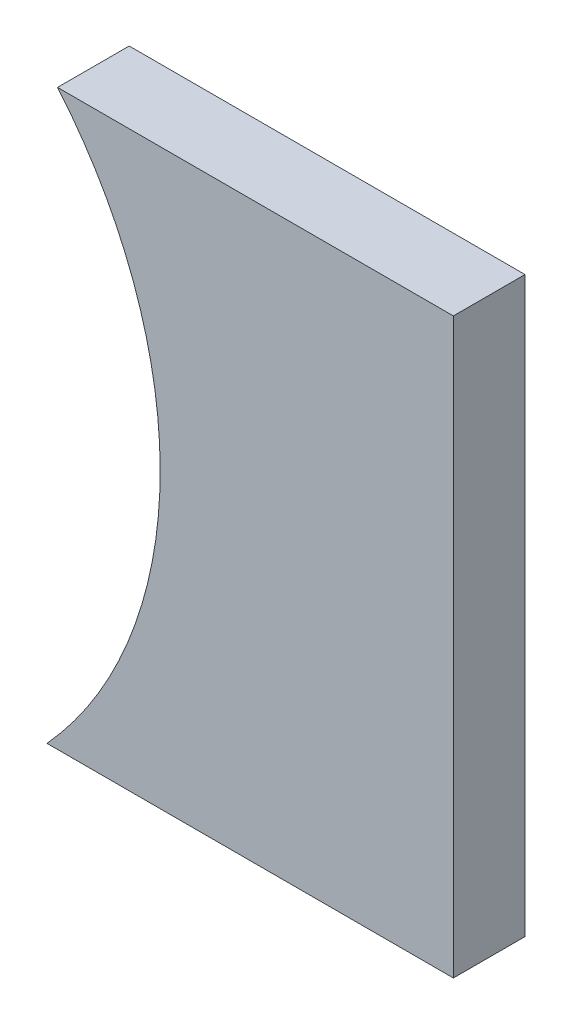
ISO-10303-21;
HEADER;
FILE_DESCRIPTION(('STEP AP214'),'2;1');
FILE_NAME('part.step','',(''),(''),'','','');
FILE_SCHEMA(('AUTOMOTIVE_DESIGN { 1 0 10303 214 1 1 1 1 }'));
ENDSEC;
DATA;
#1=APPLICATION_CONTEXT('core data for automotive mechanical design processes');
#2=APPLICATION_PROTOCOL_DEFINITION('international standard','automotive_design',2000,#1);
#3=PRODUCT_CONTEXT('',#1,'mechanical');
#4=PRODUCT('Part','Part','',(#3));
#5=PRODUCT_RELATED_PRODUCT_CATEGORY('part','',(#4));
#6=PRODUCT_DEFINITION_FORMATION('','',#4);
#7=PRODUCT_DEFINITION_CONTEXT('part definition',#1,'design');
#8=PRODUCT_DEFINITION('design','',#6,#7);
#9=PRODUCT_DEFINITION_SHAPE('','',#8);
#10=(LENGTH_UNIT() NAMED_UNIT(*) SI_UNIT(.MILLI.,.METRE.));
#11=(NAMED_UNIT(*) PLANE_ANGLE_UNIT() SI_UNIT($,.RADIAN.));
#12=(NAMED_UNIT(*) SI_UNIT($,.STERADIAN.) SOLID_ANGLE_UNIT());
#13=UNCERTAINTY_MEASURE_WITH_UNIT(LENGTH_MEASURE(1.E-05),#10,'distance_accuracy_value','');
#14=(GEOMETRIC_REPRESENTATION_CONTEXT(3) GLOBAL_UNCERTAINTY_ASSIGNED_CONTEXT((#13)) GLOBAL_UNIT_ASSIGNED_CONTEXT((#10,
#11,#12)) REPRESENTATION_CONTEXT('',''));
#15=CARTESIAN_POINT('',(0.,0.,0.));
#16=DIRECTION('',(0.,0.,1.));
#17=DIRECTION('',(1.,0.,0.));
#18=AXIS2_PLACEMENT_3D('',#15,#16,#17);
#19=CARTESIAN_POINT('',(0.,-8.65195884522402,-2.));
#20=DIRECTION('',(0.,-1.,0.));
#21=DIRECTION('',(1.,0.,0.));
#22=AXIS2_PLACEMENT_3D('',#19,#20,#21);
#23=PLANE('',#22);
#24=DIRECTION('',(0.,0.,1.));
#25=VECTOR('',#24,1.);
#26=CARTESIAN_POINT('',(51.0272013117933,-8.65195884522403,-10.));
#27=LINE('',#26,#25);
#28=CARTESIAN_POINT('',(51.0272013117933,-8.65195884522403,-2.));
#29=VERTEX_POINT('',#28);
#30=CARTESIAN_POINT('',(51.0272013117933,-8.65195884522403,0.));
#31=VERTEX_POINT('',#30);
#32=EDGE_CURVE('E60',#29,#31,#27,.T.);
#33=ORIENTED_EDGE('',*,*,#32,.F.);
#34=DIRECTION('',(1.,0.,0.));
#35=VECTOR('',#34,1.);
#36=CARTESIAN_POINT('',(0.,-8.65195884522402,-2.));
#37=LINE('',#36,#35);
#38=CARTESIAN_POINT('',(62.3676908739176,-8.65195884522404,-2.));
#39=VERTEX_POINT('',#38);
#40=EDGE_CURVE('E52',#29,#39,#37,.T.);
#41=ORIENTED_EDGE('',*,*,#40,.T.);
#42=DIRECTION('',(0.,0.,1.));
#43=VECTOR('',#42,1.);
#44=CARTESIAN_POINT('',(62.3676908739176,-8.65195884522404,-5.));
#45=LINE('',#44,#43);
#46=CARTESIAN_POINT('',(62.3676908739176,-8.65195884522404,0.));
#47=VERTEX_POINT('',#46);
#48=EDGE_CURVE('E105',#39,#47,#45,.T.);
#49=ORIENTED_EDGE('',*,*,#48,.T.);
#50=DIRECTION('',(1.,0.,0.));
#51=VECTOR('',#50,1.);
#52=CARTESIAN_POINT('',(0.,-8.65195884522402,0.));
#53=LINE('',#52,#51);
#54=EDGE_CURVE('E101',#31,#47,#53,.T.);
#55=ORIENTED_EDGE('',*,*,#54,.F.);
#56=EDGE_LOOP('',(#33,#41,#49,#55));
#57=FACE_BOUND('',#56,.T.);
#58=ADVANCED_FACE('F44',(#57),#23,.T.);
#59=CARTESIAN_POINT('',(-5.18945357340386E-13,7.3480411547712,-2.));
#60=DIRECTION('',(0.,1.,0.));
#61=DIRECTION('',(-1.,0.,0.));
#62=AXIS2_PLACEMENT_3D('',#59,#60,#61);
#63=PLANE('',#62);
#64=DIRECTION('',(0.,0.,1.));
#65=VECTOR('',#64,1.);
#66=CARTESIAN_POINT('',(51.3220777558662,7.34804115477561,-10.));
#67=LINE('',#66,#65);
#68=CARTESIAN_POINT('',(51.3220777558662,7.34804115477561,-2.));
#69=VERTEX_POINT('',#68);
#70=CARTESIAN_POINT('',(51.3220777558662,7.34804115477561,0.));
#71=VERTEX_POINT('',#70);
#72=EDGE_CURVE('E87',#69,#71,#67,.T.);
#73=ORIENTED_EDGE('',*,*,#72,.T.);
#74=DIRECTION('',(-1.,0.,0.));
#75=VECTOR('',#74,1.);
#76=CARTESIAN_POINT('',(-5.18945357340386E-13,7.3480411547712,0.));
#77=LINE('',#76,#75);
#78=CARTESIAN_POINT('',(62.3676908739176,7.34804115477561,0.));
#79=VERTEX_POINT('',#78);
#80=EDGE_CURVE('E47',#79,#71,#77,.T.);
#81=ORIENTED_EDGE('',*,*,#80,.F.);
#82=DIRECTION('',(0.,0.,1.));
#83=VECTOR('',#82,1.);
#84=CARTESIAN_POINT('',(62.3676908739176,7.34804115477561,-5.));
#85=LINE('',#84,#83);
#86=CARTESIAN_POINT('',(62.3676908739176,7.34804115477561,-2.));
#87=VERTEX_POINT('',#86);
#88=EDGE_CURVE('E68',#87,#79,#85,.T.);
#89=ORIENTED_EDGE('',*,*,#88,.F.);
#90=DIRECTION('',(-1.,0.,0.));
#91=VECTOR('',#90,1.);
#92=CARTESIAN_POINT('',(-5.18945357340386E-13,7.3480411547712,-2.));
#93=LINE('',#92,#91);
#94=EDGE_CURVE('E11',#87,#69,#93,.T.);
#95=ORIENTED_EDGE('',*,*,#94,.T.);
#96=EDGE_LOOP('',(#73,#81,#89,#95));
#97=FACE_BOUND('',#96,.T.);
#98=ADVANCED_FACE('F95',(#97),#63,.T.);
#99=CARTESIAN_POINT('',(0.,0.,-2.));
#100=DIRECTION('',(0.,0.,1.));
#101=DIRECTION('',(1.,0.,0.));
#102=AXIS2_PLACEMENT_3D('',#99,#100,#101);
#103=PLANE('',#102);
#104=ORIENTED_EDGE('',*,*,#40,.F.);
#105=CARTESIAN_POINT('',(42.0494015629422,-0.483782737463343,-2.));
#106=DIRECTION('',(0.,0.,1.));
#107=DIRECTION('',(1.,0.,0.));
#108=AXIS2_PLACEMENT_3D('',#105,#106,#107);
#109=CIRCLE('',#108,12.1375446140421);
#110=EDGE_CURVE('E97',#29,#69,#109,.T.);
#111=ORIENTED_EDGE('',*,*,#110,.T.);
#112=ORIENTED_EDGE('',*,*,#94,.F.);
#113=DIRECTION('',(0.,-1.,0.));
#114=VECTOR('',#113,1.);
#115=CARTESIAN_POINT('',(62.3676908739176,0.,-2.));
#116=LINE('',#115,#114);
#117=EDGE_CURVE('E103',#87,#39,#116,.T.);
#118=ORIENTED_EDGE('',*,*,#117,.T.);
#119=EDGE_LOOP('',(#104,#111,#112,#118));
#120=FACE_BOUND('',#119,.T.);
#121=ADVANCED_FACE('F115',(#120),#103,.F.);
#122=CARTESIAN_POINT('',(0.,0.,0.));
#123=DIRECTION('',(0.,0.,1.));
#124=DIRECTION('',(1.,0.,0.));
#125=AXIS2_PLACEMENT_3D('',#122,#123,#124);
#126=PLANE('',#125);
#127=CARTESIAN_POINT('',(42.0494015629422,-0.483782737463343,0.));
#128=DIRECTION('',(0.,0.,1.));
#129=DIRECTION('',(-1.,0.,0.));
#130=AXIS2_PLACEMENT_3D('',#127,#128,#129);
#131=CIRCLE('',#130,12.1375446140421);
#132=EDGE_CURVE('E84',#31,#71,#131,.T.);
#133=ORIENTED_EDGE('',*,*,#132,.F.);
#134=ORIENTED_EDGE('',*,*,#54,.T.);
#135=DIRECTION('',(0.,-1.,0.));
#136=VECTOR('',#135,1.);
#137=CARTESIAN_POINT('',(62.3676908739176,0.,0.));
#138=LINE('',#137,#136);
#139=EDGE_CURVE('E100',#79,#47,#138,.T.);
#140=ORIENTED_EDGE('',*,*,#139,.F.);
#141=ORIENTED_EDGE('',*,*,#80,.T.);
#142=EDGE_LOOP('',(#133,#134,#140,#141));
#143=FACE_BOUND('',#142,.T.);
#144=ADVANCED_FACE('F99',(#143),#126,.T.);
#145=CARTESIAN_POINT('',(62.3676908739176,0.,-5.));
#146=DIRECTION('',(-1.,0.,0.));
#147=DIRECTION('',(0.,-1.,0.));
#148=AXIS2_PLACEMENT_3D('',#145,#146,#147);
#149=PLANE('',#148);
#150=ORIENTED_EDGE('',*,*,#88,.T.);
#151=ORIENTED_EDGE('',*,*,#139,.T.);
#152=ORIENTED_EDGE('',*,*,#48,.F.);
#153=ORIENTED_EDGE('',*,*,#117,.F.);
#154=EDGE_LOOP('',(#150,#151,#152,#153));
#155=FACE_BOUND('',#154,.T.);
#156=ADVANCED_FACE('F118',(#155),#149,.F.);
#157=CARTESIAN_POINT('',(42.0494015629422,-0.483782737463343,-10.));
#158=DIRECTION('',(0.,0.,1.));
#159=DIRECTION('',(1.,0.,0.));
#160=AXIS2_PLACEMENT_3D('',#157,#158,#159);
#161=CYLINDRICAL_SURFACE('',#160,12.1375446140421);
#162=ORIENTED_EDGE('',*,*,#32,.T.);
#163=ORIENTED_EDGE('',*,*,#132,.T.);
#164=ORIENTED_EDGE('',*,*,#72,.F.);
#165=ORIENTED_EDGE('',*,*,#110,.F.);
#166=EDGE_LOOP('',(#162,#163,#164,#165));
#167=FACE_BOUND('',#166,.T.);
#168=ADVANCED_FACE('F86',(#167),#161,.F.);
#169=CLOSED_SHELL('',(#58,#98,#121,#144,#156,#168));
#170=MANIFOLD_SOLID_BREP('B2',#169);
#171=ADVANCED_BREP_SHAPE_REPRESENTATION('',(#18,#170),#14);
#172=SHAPE_DEFINITION_REPRESENTATION(#9,#171);
ENDSEC;
END-ISO-10303-21;
